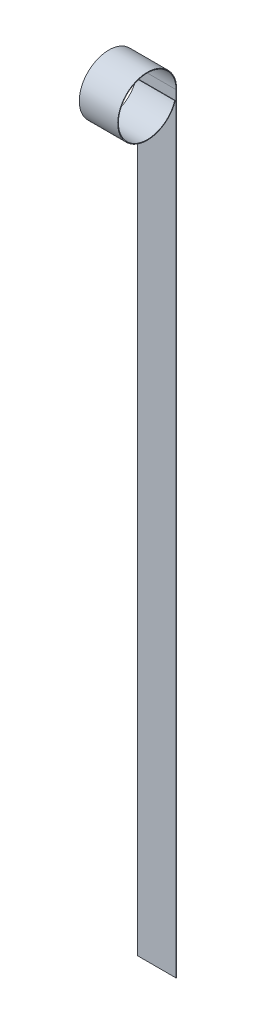
ISO-10303-21;
HEADER;
FILE_DESCRIPTION(('STEP AP214'),'2;1');
FILE_NAME('part.step','',(''),(''),'','','');
FILE_SCHEMA(('AUTOMOTIVE_DESIGN { 1 0 10303 214 1 1 1 1 }'));
ENDSEC;
DATA;
#1=APPLICATION_CONTEXT('core data for automotive mechanical design processes');
#2=APPLICATION_PROTOCOL_DEFINITION('international standard','automotive_design',2000,#1);
#3=PRODUCT_CONTEXT('',#1,'mechanical');
#4=PRODUCT('Part','Part','',(#3));
#5=PRODUCT_RELATED_PRODUCT_CATEGORY('part','',(#4));
#6=PRODUCT_DEFINITION_FORMATION('','',#4);
#7=PRODUCT_DEFINITION_CONTEXT('part definition',#1,'design');
#8=PRODUCT_DEFINITION('design','',#6,#7);
#9=PRODUCT_DEFINITION_SHAPE('','',#8);
#10=(LENGTH_UNIT() NAMED_UNIT(*) SI_UNIT(.MILLI.,.METRE.));
#11=(NAMED_UNIT(*) PLANE_ANGLE_UNIT() SI_UNIT($,.RADIAN.));
#12=(NAMED_UNIT(*) SI_UNIT($,.STERADIAN.) SOLID_ANGLE_UNIT());
#13=UNCERTAINTY_MEASURE_WITH_UNIT(LENGTH_MEASURE(1.E-05),#10,'distance_accuracy_value','');
#14=(GEOMETRIC_REPRESENTATION_CONTEXT(3) GLOBAL_UNCERTAINTY_ASSIGNED_CONTEXT((#13)) GLOBAL_UNIT_ASSIGNED_CONTEXT((#10,
#11,#12)) REPRESENTATION_CONTEXT('',''));
#15=CARTESIAN_POINT('',(0.,0.,0.));
#16=DIRECTION('',(0.,0.,1.));
#17=DIRECTION('',(1.,0.,0.));
#18=AXIS2_PLACEMENT_3D('',#15,#16,#17);
#19=CARTESIAN_POINT('',(19.05,0.,0.));
#20=DIRECTION('',(-1.,0.,0.));
#21=DIRECTION('',(0.,0.,1.));
#22=AXIS2_PLACEMENT_3D('',#19,#20,#21);
#23=CYLINDRICAL_SURFACE('',#22,29.21);
#24=CARTESIAN_POINT('',(-19.05,0.,0.));
#25=DIRECTION('',(1.,0.,0.));
#26=DIRECTION('',(0.,0.,-1.));
#27=AXIS2_PLACEMENT_3D('',#24,#25,#26);
#28=CIRCLE('',#27,29.21);
#29=CARTESIAN_POINT('',(-19.05,0.,-29.21));
#30=VERTEX_POINT('',#29);
#31=CARTESIAN_POINT('',(-19.05,-8.9046122322521,-27.8196330132737));
#32=VERTEX_POINT('',#31);
#33=EDGE_CURVE('E114',#30,#32,#28,.T.);
#34=ORIENTED_EDGE('',*,*,#33,.T.);
#35=DIRECTION('',(-1.,0.,0.));
#36=VECTOR('',#35,1.);
#37=CARTESIAN_POINT('',(19.05,-8.9046122322521,-27.8196330132737));
#38=LINE('',#37,#36);
#39=CARTESIAN_POINT('',(19.05,-8.9046122322521,-27.8196330132737));
#40=VERTEX_POINT('',#39);
#41=EDGE_CURVE('E11',#40,#32,#38,.T.);
#42=ORIENTED_EDGE('',*,*,#41,.F.);
#43=CARTESIAN_POINT('',(19.05,0.,0.));
#44=DIRECTION('',(1.,0.,0.));
#45=DIRECTION('',(0.,0.,-1.));
#46=AXIS2_PLACEMENT_3D('',#43,#44,#45);
#47=CIRCLE('',#46,29.21);
#48=CARTESIAN_POINT('',(19.05,0.,-29.21));
#49=VERTEX_POINT('',#48);
#50=EDGE_CURVE('E79',#49,#40,#47,.T.);
#51=ORIENTED_EDGE('',*,*,#50,.F.);
#52=DIRECTION('',(-1.,0.,0.));
#53=VECTOR('',#52,1.);
#54=CARTESIAN_POINT('',(19.05,0.,-29.21));
#55=LINE('',#54,#53);
#56=EDGE_CURVE('E110',#49,#30,#55,.T.);
#57=ORIENTED_EDGE('',*,*,#56,.T.);
#58=EDGE_LOOP('',(#34,#42,#51,#57));
#59=FACE_BOUND('',#58,.T.);
#60=ADVANCED_FACE('F33',(#59),#23,.T.);
#61=CARTESIAN_POINT('',(19.05,-8.71103370546401,-27.2148583825503));
#62=DIRECTION('',(0.,0.952400993265103,-0.304848073682032));
#63=DIRECTION('',(0.,0.304848073682032,0.952400993265103));
#64=AXIS2_PLACEMENT_3D('',#61,#62,#63);
#65=PLANE('',#64);
#66=DIRECTION('',(0.,-0.304848073682032,-0.952400993265103));
#67=VECTOR('',#66,1.);
#68=CARTESIAN_POINT('',(-19.05,-8.71103370546401,-27.2148583825503));
#69=LINE('',#68,#67);
#70=CARTESIAN_POINT('',(-19.05,-8.71103370546401,-27.2148583825503));
#71=VERTEX_POINT('',#70);
#72=EDGE_CURVE('E117',#71,#32,#69,.T.);
#73=ORIENTED_EDGE('',*,*,#72,.F.);
#74=DIRECTION('',(-1.,0.,0.));
#75=VECTOR('',#74,1.);
#76=CARTESIAN_POINT('',(19.05,-8.71103370546401,-27.2148583825503));
#77=LINE('',#76,#75);
#78=CARTESIAN_POINT('',(19.05,-8.71103370546401,-27.2148583825503));
#79=VERTEX_POINT('',#78);
#80=EDGE_CURVE('E41',#79,#71,#77,.T.);
#81=ORIENTED_EDGE('',*,*,#80,.F.);
#82=DIRECTION('',(0.,-0.304848073682032,-0.952400993265103));
#83=VECTOR('',#82,1.);
#84=CARTESIAN_POINT('',(19.05,-8.71103370546401,-27.2148583825503));
#85=LINE('',#84,#83);
#86=EDGE_CURVE('E203',#79,#40,#85,.T.);
#87=ORIENTED_EDGE('',*,*,#86,.T.);
#88=ORIENTED_EDGE('',*,*,#41,.T.);
#89=EDGE_LOOP('',(#73,#81,#87,#88));
#90=FACE_BOUND('',#89,.T.);
#91=ADVANCED_FACE('F135',(#90),#65,.T.);
#92=CARTESIAN_POINT('',(19.05,0.,0.));
#93=DIRECTION('',(-1.,0.,0.));
#94=DIRECTION('',(0.,0.,1.));
#95=AXIS2_PLACEMENT_3D('',#92,#93,#94);
#96=CYLINDRICAL_SURFACE('',#95,28.575);
#97=CARTESIAN_POINT('',(-19.05,0.,0.));
#98=DIRECTION('',(1.,0.,0.));
#99=DIRECTION('',(0.,0.,-1.));
#100=AXIS2_PLACEMENT_3D('',#97,#98,#99);
#101=CIRCLE('',#100,28.575);
#102=CARTESIAN_POINT('',(-19.05,0.,-28.575));
#103=VERTEX_POINT('',#102);
#104=EDGE_CURVE('E120',#103,#71,#101,.T.);
#105=ORIENTED_EDGE('',*,*,#104,.F.);
#106=DIRECTION('',(-1.,0.,0.));
#107=VECTOR('',#106,1.);
#108=CARTESIAN_POINT('',(19.05,0.,-28.575));
#109=LINE('',#108,#107);
#110=CARTESIAN_POINT('',(19.05,0.,-28.575));
#111=VERTEX_POINT('',#110);
#112=EDGE_CURVE('E100',#111,#103,#109,.T.);
#113=ORIENTED_EDGE('',*,*,#112,.F.);
#114=CARTESIAN_POINT('',(19.05,0.,0.));
#115=DIRECTION('',(1.,0.,0.));
#116=DIRECTION('',(0.,0.,-1.));
#117=AXIS2_PLACEMENT_3D('',#114,#115,#116);
#118=CIRCLE('',#117,28.575);
#119=EDGE_CURVE('E106',#111,#79,#118,.T.);
#120=ORIENTED_EDGE('',*,*,#119,.T.);
#121=ORIENTED_EDGE('',*,*,#80,.T.);
#122=EDGE_LOOP('',(#105,#113,#120,#121));
#123=FACE_BOUND('',#122,.T.);
#124=ADVANCED_FACE('F132',(#123),#96,.F.);
#125=CARTESIAN_POINT('',(19.05,0.,-28.575));
#126=DIRECTION('',(0.,0.,1.));
#127=DIRECTION('',(0.,-1.,0.));
#128=AXIS2_PLACEMENT_3D('',#125,#126,#127);
#129=PLANE('',#128);
#130=DIRECTION('',(0.,1.,0.));
#131=VECTOR('',#130,1.);
#132=CARTESIAN_POINT('',(-19.05,0.,-28.575));
#133=LINE('',#132,#131);
#134=CARTESIAN_POINT('',(-19.05,-762.,-28.5750000000001));
#135=VERTEX_POINT('',#134);
#136=EDGE_CURVE('E95',#135,#103,#133,.T.);
#137=ORIENTED_EDGE('',*,*,#136,.F.);
#138=DIRECTION('',(-1.,0.,0.));
#139=VECTOR('',#138,1.);
#140=CARTESIAN_POINT('',(19.05,-762.,-28.5750000000001));
#141=LINE('',#140,#139);
#142=CARTESIAN_POINT('',(19.05,-762.,-28.5750000000001));
#143=VERTEX_POINT('',#142);
#144=EDGE_CURVE('E90',#143,#135,#141,.T.);
#145=ORIENTED_EDGE('',*,*,#144,.F.);
#146=DIRECTION('',(0.,1.,0.));
#147=VECTOR('',#146,1.);
#148=CARTESIAN_POINT('',(19.05,0.,-28.575));
#149=LINE('',#148,#147);
#150=EDGE_CURVE('E93',#143,#111,#149,.T.);
#151=ORIENTED_EDGE('',*,*,#150,.T.);
#152=ORIENTED_EDGE('',*,*,#112,.T.);
#153=EDGE_LOOP('',(#137,#145,#151,#152));
#154=FACE_BOUND('',#153,.T.);
#155=ADVANCED_FACE('F92',(#154),#129,.T.);
#156=CARTESIAN_POINT('',(19.05,-762.,-29.2100000000001));
#157=DIRECTION('',(0.,-1.,0.));
#158=DIRECTION('',(0.,0.,-1.));
#159=AXIS2_PLACEMENT_3D('',#156,#157,#158);
#160=PLANE('',#159);
#161=DIRECTION('',(0.,0.,1.));
#162=VECTOR('',#161,1.);
#163=CARTESIAN_POINT('',(-19.05,-762.,-29.2100000000001));
#164=LINE('',#163,#162);
#165=CARTESIAN_POINT('',(-19.05,-762.,-29.2100000000001));
#166=VERTEX_POINT('',#165);
#167=EDGE_CURVE('E124',#166,#135,#164,.T.);
#168=ORIENTED_EDGE('',*,*,#167,.F.);
#169=DIRECTION('',(-1.,0.,0.));
#170=VECTOR('',#169,1.);
#171=CARTESIAN_POINT('',(19.05,-762.,-29.2100000000001));
#172=LINE('',#171,#170);
#173=CARTESIAN_POINT('',(19.05,-762.,-29.2100000000001));
#174=VERTEX_POINT('',#173);
#175=EDGE_CURVE('E70',#174,#166,#172,.T.);
#176=ORIENTED_EDGE('',*,*,#175,.F.);
#177=DIRECTION('',(0.,0.,1.));
#178=VECTOR('',#177,1.);
#179=CARTESIAN_POINT('',(19.05,-762.,-29.2100000000001));
#180=LINE('',#179,#178);
#181=EDGE_CURVE('E104',#174,#143,#180,.T.);
#182=ORIENTED_EDGE('',*,*,#181,.T.);
#183=ORIENTED_EDGE('',*,*,#144,.T.);
#184=EDGE_LOOP('',(#168,#176,#182,#183));
#185=FACE_BOUND('',#184,.T.);
#186=ADVANCED_FACE('F108',(#185),#160,.T.);
#187=CARTESIAN_POINT('',(19.05,0.,-29.21));
#188=DIRECTION('',(0.,0.,1.));
#189=DIRECTION('',(0.,-1.,0.));
#190=AXIS2_PLACEMENT_3D('',#187,#188,#189);
#191=PLANE('',#190);
#192=DIRECTION('',(0.,1.,0.));
#193=VECTOR('',#192,1.);
#194=CARTESIAN_POINT('',(-19.05,0.,-29.21));
#195=LINE('',#194,#193);
#196=EDGE_CURVE('E73',#166,#30,#195,.T.);
#197=ORIENTED_EDGE('',*,*,#196,.T.);
#198=ORIENTED_EDGE('',*,*,#56,.F.);
#199=DIRECTION('',(0.,1.,0.));
#200=VECTOR('',#199,1.);
#201=CARTESIAN_POINT('',(19.05,0.,-29.21));
#202=LINE('',#201,#200);
#203=EDGE_CURVE('E49',#174,#49,#202,.T.);
#204=ORIENTED_EDGE('',*,*,#203,.F.);
#205=ORIENTED_EDGE('',*,*,#175,.T.);
#206=EDGE_LOOP('',(#197,#198,#204,#205));
#207=FACE_BOUND('',#206,.T.);
#208=ADVANCED_FACE('F140',(#207),#191,.F.);
#209=CARTESIAN_POINT('',(19.05,0.,0.));
#210=DIRECTION('',(1.,0.,0.));
#211=DIRECTION('',(0.,0.,-1.));
#212=AXIS2_PLACEMENT_3D('',#209,#210,#211);
#213=PLANE('',#212);
#214=ORIENTED_EDGE('',*,*,#50,.T.);
#215=ORIENTED_EDGE('',*,*,#86,.F.);
#216=ORIENTED_EDGE('',*,*,#119,.F.);
#217=ORIENTED_EDGE('',*,*,#150,.F.);
#218=ORIENTED_EDGE('',*,*,#181,.F.);
#219=ORIENTED_EDGE('',*,*,#203,.T.);
#220=EDGE_LOOP('',(#214,#215,#216,#217,#218,#219));
#221=FACE_BOUND('',#220,.T.);
#222=ADVANCED_FACE('F103',(#221),#213,.T.);
#223=CARTESIAN_POINT('',(-19.05,0.,0.));
#224=DIRECTION('',(1.,0.,0.));
#225=DIRECTION('',(0.,0.,-1.));
#226=AXIS2_PLACEMENT_3D('',#223,#224,#225);
#227=PLANE('',#226);
#228=ORIENTED_EDGE('',*,*,#33,.F.);
#229=ORIENTED_EDGE('',*,*,#196,.F.);
#230=ORIENTED_EDGE('',*,*,#167,.T.);
#231=ORIENTED_EDGE('',*,*,#136,.T.);
#232=ORIENTED_EDGE('',*,*,#104,.T.);
#233=ORIENTED_EDGE('',*,*,#72,.T.);
#234=EDGE_LOOP('',(#228,#229,#230,#231,#232,#233));
#235=FACE_BOUND('',#234,.T.);
#236=ADVANCED_FACE('F138',(#235),#227,.F.);
#237=CLOSED_SHELL('',(#60,#91,#124,#155,#186,#208,#222,#236));
#238=MANIFOLD_SOLID_BREP('B2',#237);
#239=ADVANCED_BREP_SHAPE_REPRESENTATION('',(#18,#238),#14);
#240=SHAPE_DEFINITION_REPRESENTATION(#9,#239);
ENDSEC;
END-ISO-10303-21;
